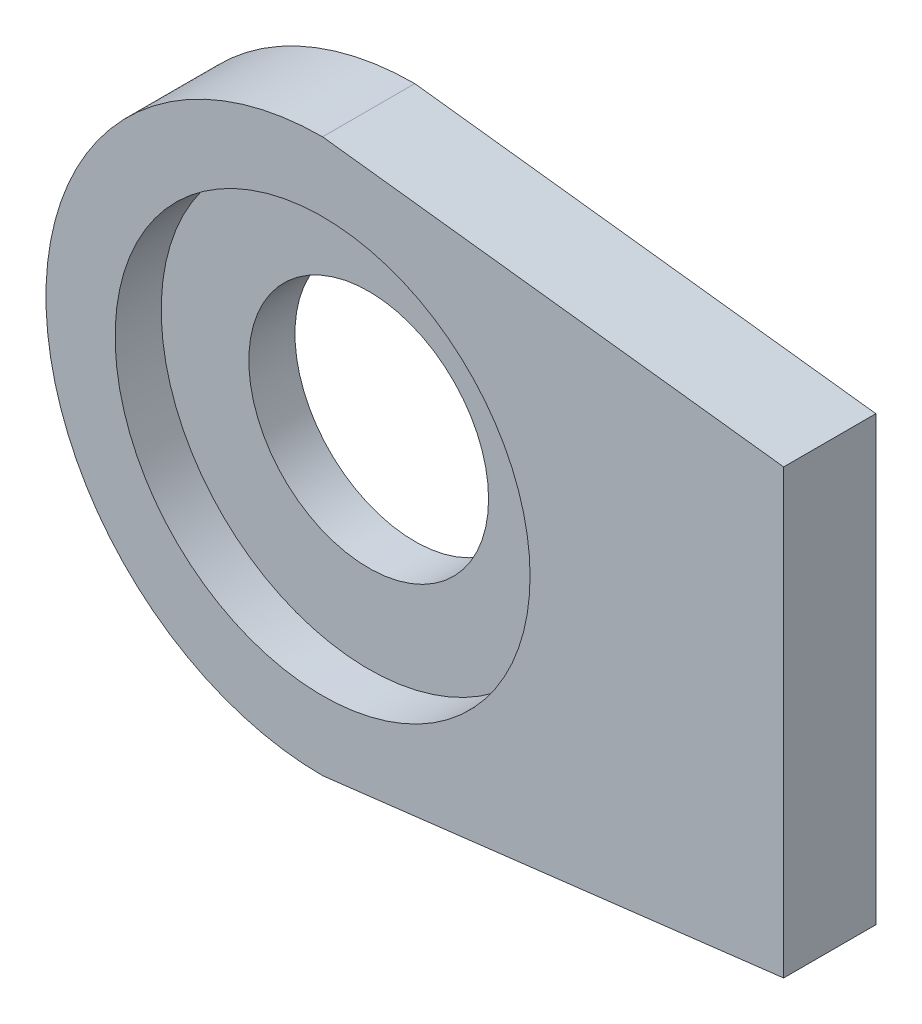
ISO-10303-21;
HEADER;
FILE_DESCRIPTION(('STEP AP214'),'2;1');
FILE_NAME('part.step','',(''),(''),'','','');
FILE_SCHEMA(('AUTOMOTIVE_DESIGN { 1 0 10303 214 1 1 1 1 }'));
ENDSEC;
DATA;
#1=APPLICATION_CONTEXT('core data for automotive mechanical design processes');
#2=APPLICATION_PROTOCOL_DEFINITION('international standard','automotive_design',2000,#1);
#3=PRODUCT_CONTEXT('',#1,'mechanical');
#4=PRODUCT('Part','Part','',(#3));
#5=PRODUCT_RELATED_PRODUCT_CATEGORY('part','',(#4));
#6=PRODUCT_DEFINITION_FORMATION('','',#4);
#7=PRODUCT_DEFINITION_CONTEXT('part definition',#1,'design');
#8=PRODUCT_DEFINITION('design','',#6,#7);
#9=PRODUCT_DEFINITION_SHAPE('','',#8);
#10=(LENGTH_UNIT() NAMED_UNIT(*) SI_UNIT(.MILLI.,.METRE.));
#11=(NAMED_UNIT(*) PLANE_ANGLE_UNIT() SI_UNIT($,.RADIAN.));
#12=(NAMED_UNIT(*) SI_UNIT($,.STERADIAN.) SOLID_ANGLE_UNIT());
#13=UNCERTAINTY_MEASURE_WITH_UNIT(LENGTH_MEASURE(1.E-05),#10,'distance_accuracy_value','');
#14=(GEOMETRIC_REPRESENTATION_CONTEXT(3) GLOBAL_UNCERTAINTY_ASSIGNED_CONTEXT((#13)) GLOBAL_UNIT_ASSIGNED_CONTEXT((#10,
#11,#12)) REPRESENTATION_CONTEXT('',''));
#15=CARTESIAN_POINT('',(0.,0.,0.));
#16=DIRECTION('',(0.,0.,1.));
#17=DIRECTION('',(1.,0.,0.));
#18=AXIS2_PLACEMENT_3D('',#15,#16,#17);
#19=CARTESIAN_POINT('',(0.,0.,0.));
#20=DIRECTION('',(0.,0.,1.));
#21=DIRECTION('',(1.,0.,0.));
#22=AXIS2_PLACEMENT_3D('',#19,#20,#21);
#23=CYLINDRICAL_SURFACE('',#22,2.6);
#24=CARTESIAN_POINT('',(0.,0.,0.));
#25=DIRECTION('',(0.,0.,1.));
#26=DIRECTION('',(1.,0.,0.));
#27=AXIS2_PLACEMENT_3D('',#24,#25,#26);
#28=CIRCLE('',#27,2.6);
#29=CARTESIAN_POINT('',(2.6,0.,0.));
#30=VERTEX_POINT('',#29);
#31=EDGE_CURVE('E106',#30,#30,#28,.T.);
#32=ORIENTED_EDGE('',*,*,#31,.F.);
#33=EDGE_LOOP('',(#32));
#34=FACE_BOUND('',#33,.T.);
#35=CARTESIAN_POINT('',(0.,0.,1.));
#36=DIRECTION('',(0.,0.,1.));
#37=DIRECTION('',(1.,0.,0.));
#38=AXIS2_PLACEMENT_3D('',#35,#36,#37);
#39=CIRCLE('',#38,2.6);
#40=CARTESIAN_POINT('',(2.6,0.,1.));
#41=VERTEX_POINT('',#40);
#42=EDGE_CURVE('E41',#41,#41,#39,.F.);
#43=ORIENTED_EDGE('',*,*,#42,.F.);
#44=EDGE_LOOP('',(#43));
#45=FACE_BOUND('',#44,.T.);
#46=ADVANCED_FACE('F37',(#34,#45),#23,.F.);
#47=CARTESIAN_POINT('',(0.,0.,2.));
#48=DIRECTION('',(0.,0.,-1.));
#49=DIRECTION('',(-1.,0.,0.));
#50=AXIS2_PLACEMENT_3D('',#47,#48,#49);
#51=CYLINDRICAL_SURFACE('',#50,6.);
#52=CARTESIAN_POINT('',(0.,0.,0.));
#53=DIRECTION('',(0.,0.,1.));
#54=DIRECTION('',(1.,0.,0.));
#55=AXIS2_PLACEMENT_3D('',#52,#53,#54);
#56=CIRCLE('',#55,6.);
#57=CARTESIAN_POINT('',(0.,6.,0.));
#58=VERTEX_POINT('',#57);
#59=CARTESIAN_POINT('',(0.,-6.,0.));
#60=VERTEX_POINT('',#59);
#61=EDGE_CURVE('E103',#58,#60,#56,.T.);
#62=ORIENTED_EDGE('',*,*,#61,.T.);
#63=DIRECTION('',(0.,0.,-1.));
#64=VECTOR('',#63,1.);
#65=CARTESIAN_POINT('',(0.,-6.,2.));
#66=LINE('',#65,#64);
#67=CARTESIAN_POINT('',(0.,-6.,2.));
#68=VERTEX_POINT('',#67);
#69=EDGE_CURVE('E11',#68,#60,#66,.T.);
#70=ORIENTED_EDGE('',*,*,#69,.F.);
#71=CARTESIAN_POINT('',(0.,0.,2.));
#72=DIRECTION('',(0.,0.,1.));
#73=DIRECTION('',(1.,0.,0.));
#74=AXIS2_PLACEMENT_3D('',#71,#72,#73);
#75=CIRCLE('',#74,6.);
#76=CARTESIAN_POINT('',(0.,6.,2.));
#77=VERTEX_POINT('',#76);
#78=EDGE_CURVE('E90',#77,#68,#75,.T.);
#79=ORIENTED_EDGE('',*,*,#78,.F.);
#80=DIRECTION('',(0.,0.,-1.));
#81=VECTOR('',#80,1.);
#82=CARTESIAN_POINT('',(0.,6.,2.));
#83=LINE('',#82,#81);
#84=EDGE_CURVE('E99',#77,#58,#83,.T.);
#85=ORIENTED_EDGE('',*,*,#84,.T.);
#86=EDGE_LOOP('',(#62,#70,#79,#85));
#87=FACE_BOUND('',#86,.T.);
#88=ADVANCED_FACE('F39',(#87),#51,.T.);
#89=CARTESIAN_POINT('',(0.,-6.,2.));
#90=DIRECTION('',(-0.119145220618431,0.992876838486922,0.));
#91=DIRECTION('',(-0.992876838486922,-0.119145220618431,0.));
#92=AXIS2_PLACEMENT_3D('',#89,#90,#91);
#93=PLANE('',#92);
#94=DIRECTION('',(0.992876838486922,0.119145220618431,0.));
#95=VECTOR('',#94,1.);
#96=CARTESIAN_POINT('',(0.,-6.,0.));
#97=LINE('',#96,#95);
#98=CARTESIAN_POINT('',(10.,-4.8,0.));
#99=VERTEX_POINT('',#98);
#100=EDGE_CURVE('E94',#60,#99,#97,.T.);
#101=ORIENTED_EDGE('',*,*,#100,.T.);
#102=DIRECTION('',(0.,0.,-1.));
#103=VECTOR('',#102,1.);
#104=CARTESIAN_POINT('',(10.,-4.8,2.));
#105=LINE('',#104,#103);
#106=CARTESIAN_POINT('',(10.,-4.8,2.));
#107=VERTEX_POINT('',#106);
#108=EDGE_CURVE('E47',#107,#99,#105,.T.);
#109=ORIENTED_EDGE('',*,*,#108,.F.);
#110=DIRECTION('',(0.992876838486922,0.119145220618431,0.));
#111=VECTOR('',#110,1.);
#112=CARTESIAN_POINT('',(0.,-6.,2.));
#113=LINE('',#112,#111);
#114=EDGE_CURVE('E85',#68,#107,#113,.T.);
#115=ORIENTED_EDGE('',*,*,#114,.F.);
#116=ORIENTED_EDGE('',*,*,#69,.T.);
#117=EDGE_LOOP('',(#101,#109,#115,#116));
#118=FACE_BOUND('',#117,.T.);
#119=ADVANCED_FACE('F93',(#118),#93,.F.);
#120=CARTESIAN_POINT('',(10.,-4.8,2.));
#121=DIRECTION('',(-1.,0.,0.));
#122=DIRECTION('',(0.,0.,1.));
#123=AXIS2_PLACEMENT_3D('',#120,#121,#122);
#124=PLANE('',#123);
#125=DIRECTION('',(0.,1.,0.));
#126=VECTOR('',#125,1.);
#127=CARTESIAN_POINT('',(10.,-4.8,0.));
#128=LINE('',#127,#126);
#129=CARTESIAN_POINT('',(10.,4.8,0.));
#130=VERTEX_POINT('',#129);
#131=EDGE_CURVE('E72',#99,#130,#128,.T.);
#132=ORIENTED_EDGE('',*,*,#131,.T.);
#133=DIRECTION('',(0.,0.,-1.));
#134=VECTOR('',#133,1.);
#135=CARTESIAN_POINT('',(10.,4.8,2.));
#136=LINE('',#135,#134);
#137=CARTESIAN_POINT('',(10.,4.8,2.));
#138=VERTEX_POINT('',#137);
#139=EDGE_CURVE('E95',#138,#130,#136,.T.);
#140=ORIENTED_EDGE('',*,*,#139,.F.);
#141=DIRECTION('',(0.,1.,0.));
#142=VECTOR('',#141,1.);
#143=CARTESIAN_POINT('',(10.,-4.8,2.));
#144=LINE('',#143,#142);
#145=EDGE_CURVE('E88',#107,#138,#144,.T.);
#146=ORIENTED_EDGE('',*,*,#145,.F.);
#147=ORIENTED_EDGE('',*,*,#108,.T.);
#148=EDGE_LOOP('',(#132,#140,#146,#147));
#149=FACE_BOUND('',#148,.T.);
#150=ADVANCED_FACE('F97',(#149),#124,.F.);
#151=CARTESIAN_POINT('',(0.,6.,2.));
#152=DIRECTION('',(-0.119145220618431,-0.992876838486922,0.));
#153=DIRECTION('',(0.992876838486922,-0.119145220618431,0.));
#154=AXIS2_PLACEMENT_3D('',#151,#152,#153);
#155=PLANE('',#154);
#156=DIRECTION('',(-0.992876838486922,0.119145220618431,0.));
#157=VECTOR('',#156,1.);
#158=CARTESIAN_POINT('',(0.,6.,0.));
#159=LINE('',#158,#157);
#160=EDGE_CURVE('E78',#130,#58,#159,.T.);
#161=ORIENTED_EDGE('',*,*,#160,.T.);
#162=ORIENTED_EDGE('',*,*,#84,.F.);
#163=DIRECTION('',(-0.992876838486922,0.119145220618431,0.));
#164=VECTOR('',#163,1.);
#165=CARTESIAN_POINT('',(0.,6.,2.));
#166=LINE('',#165,#164);
#167=EDGE_CURVE('E55',#138,#77,#166,.T.);
#168=ORIENTED_EDGE('',*,*,#167,.F.);
#169=ORIENTED_EDGE('',*,*,#139,.T.);
#170=EDGE_LOOP('',(#161,#162,#168,#169));
#171=FACE_BOUND('',#170,.T.);
#172=ADVANCED_FACE('F111',(#171),#155,.F.);
#173=CARTESIAN_POINT('',(0.,0.,2.));
#174=DIRECTION('',(0.,0.,1.));
#175=DIRECTION('',(1.,0.,0.));
#176=AXIS2_PLACEMENT_3D('',#173,#174,#175);
#177=PLANE('',#176);
#178=CARTESIAN_POINT('',(0.,0.,2.));
#179=DIRECTION('',(0.,0.,1.));
#180=DIRECTION('',(1.,0.,0.));
#181=AXIS2_PLACEMENT_3D('',#178,#179,#180);
#182=CIRCLE('',#181,4.5);
#183=CARTESIAN_POINT('',(4.5,0.,2.));
#184=VERTEX_POINT('',#183);
#185=EDGE_CURVE('E119',#184,#184,#182,.T.);
#186=ORIENTED_EDGE('',*,*,#185,.F.);
#187=EDGE_LOOP('',(#186));
#188=FACE_BOUND('',#187,.T.);
#189=ORIENTED_EDGE('',*,*,#78,.T.);
#190=ORIENTED_EDGE('',*,*,#114,.T.);
#191=ORIENTED_EDGE('',*,*,#145,.T.);
#192=ORIENTED_EDGE('',*,*,#167,.T.);
#193=EDGE_LOOP('',(#189,#190,#191,#192));
#194=FACE_BOUND('',#193,.T.);
#195=ADVANCED_FACE('F86',(#188,#194),#177,.T.);
#196=CARTESIAN_POINT('',(0.,0.,0.));
#197=DIRECTION('',(0.,0.,1.));
#198=DIRECTION('',(1.,0.,0.));
#199=AXIS2_PLACEMENT_3D('',#196,#197,#198);
#200=PLANE('',#199);
#201=ORIENTED_EDGE('',*,*,#31,.T.);
#202=EDGE_LOOP('',(#201));
#203=FACE_BOUND('',#202,.T.);
#204=ORIENTED_EDGE('',*,*,#61,.F.);
#205=ORIENTED_EDGE('',*,*,#160,.F.);
#206=ORIENTED_EDGE('',*,*,#131,.F.);
#207=ORIENTED_EDGE('',*,*,#100,.F.);
#208=EDGE_LOOP('',(#204,#205,#206,#207));
#209=FACE_BOUND('',#208,.T.);
#210=ADVANCED_FACE('F114',(#203,#209),#200,.F.);
#211=CARTESIAN_POINT('',(0.,0.,1.));
#212=DIRECTION('',(0.,0.,1.));
#213=DIRECTION('',(1.,0.,0.));
#214=AXIS2_PLACEMENT_3D('',#211,#212,#213);
#215=PLANE('',#214);
#216=CARTESIAN_POINT('',(0.,0.,1.));
#217=DIRECTION('',(0.,0.,1.));
#218=DIRECTION('',(1.,0.,0.));
#219=AXIS2_PLACEMENT_3D('',#216,#217,#218);
#220=CIRCLE('',#219,4.5);
#221=CARTESIAN_POINT('',(4.5,0.,1.));
#222=VERTEX_POINT('',#221);
#223=EDGE_CURVE('E122',#222,#222,#220,.T.);
#224=ORIENTED_EDGE('',*,*,#223,.T.);
#225=EDGE_LOOP('',(#224));
#226=FACE_BOUND('',#225,.T.);
#227=ORIENTED_EDGE('',*,*,#42,.T.);
#228=EDGE_LOOP('',(#227));
#229=FACE_BOUND('',#228,.T.);
#230=ADVANCED_FACE('F129',(#226,#229),#215,.T.);
#231=CARTESIAN_POINT('',(0.,0.,1.));
#232=DIRECTION('',(0.,0.,1.));
#233=DIRECTION('',(1.,0.,0.));
#234=AXIS2_PLACEMENT_3D('',#231,#232,#233);
#235=CYLINDRICAL_SURFACE('',#234,4.5);
#236=ORIENTED_EDGE('',*,*,#223,.F.);
#237=EDGE_LOOP('',(#236));
#238=FACE_BOUND('',#237,.T.);
#239=ORIENTED_EDGE('',*,*,#185,.T.);
#240=EDGE_LOOP('',(#239));
#241=FACE_BOUND('',#240,.T.);
#242=ADVANCED_FACE('F140',(#238,#241),#235,.F.);
#243=CLOSED_SHELL('',(#46,#88,#119,#150,#172,#195,#210,#230,#242));
#244=MANIFOLD_SOLID_BREP('B2',#243);
#245=ADVANCED_BREP_SHAPE_REPRESENTATION('',(#18,#244),#14);
#246=SHAPE_DEFINITION_REPRESENTATION(#9,#245);
ENDSEC;
END-ISO-10303-21;
